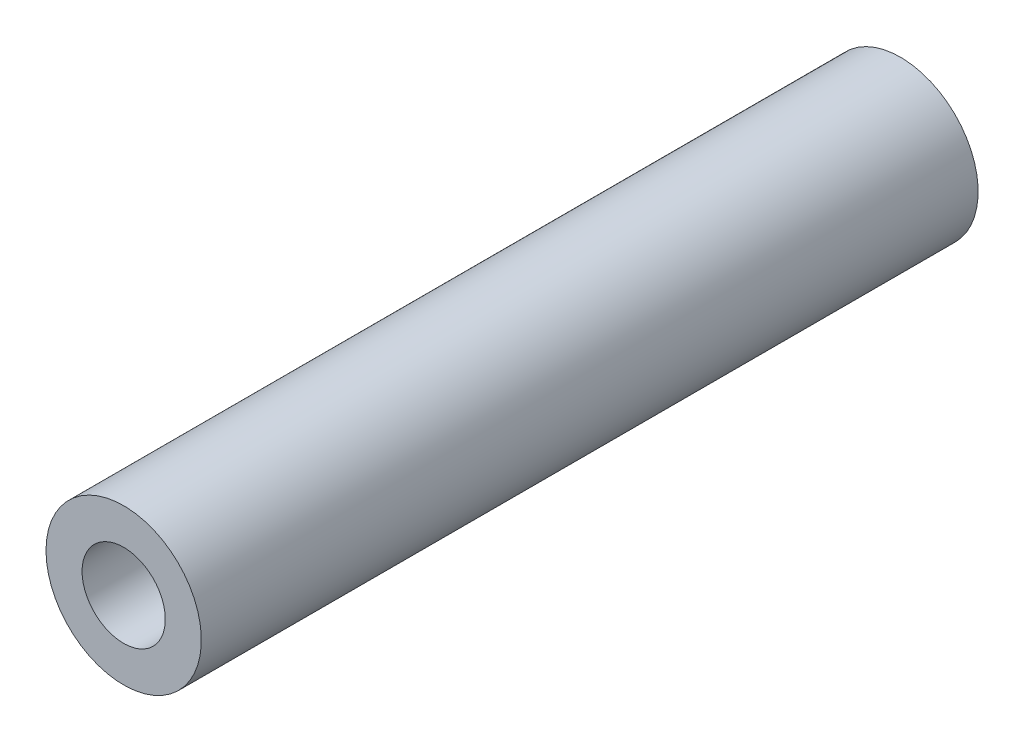
ISO-10303-21;
HEADER;
FILE_DESCRIPTION(('STEP AP214'),'2;1');
FILE_NAME('part.step','',(''),(''),'','','');
FILE_SCHEMA(('AUTOMOTIVE_DESIGN { 1 0 10303 214 1 1 1 1 }'));
ENDSEC;
DATA;
#1=APPLICATION_CONTEXT('core data for automotive mechanical design processes');
#2=APPLICATION_PROTOCOL_DEFINITION('international standard','automotive_design',2000,#1);
#3=PRODUCT_CONTEXT('',#1,'mechanical');
#4=PRODUCT('Part','Part','',(#3));
#5=PRODUCT_RELATED_PRODUCT_CATEGORY('part','',(#4));
#6=PRODUCT_DEFINITION_FORMATION('','',#4);
#7=PRODUCT_DEFINITION_CONTEXT('part definition',#1,'design');
#8=PRODUCT_DEFINITION('design','',#6,#7);
#9=PRODUCT_DEFINITION_SHAPE('','',#8);
#10=(LENGTH_UNIT() NAMED_UNIT(*) SI_UNIT(.MILLI.,.METRE.));
#11=(NAMED_UNIT(*) PLANE_ANGLE_UNIT() SI_UNIT($,.RADIAN.));
#12=(NAMED_UNIT(*) SI_UNIT($,.STERADIAN.) SOLID_ANGLE_UNIT());
#13=UNCERTAINTY_MEASURE_WITH_UNIT(LENGTH_MEASURE(1.E-05),#10,'distance_accuracy_value','');
#14=(GEOMETRIC_REPRESENTATION_CONTEXT(3) GLOBAL_UNCERTAINTY_ASSIGNED_CONTEXT((#13)) GLOBAL_UNIT_ASSIGNED_CONTEXT((#10,
#11,#12)) REPRESENTATION_CONTEXT('',''));
#15=CARTESIAN_POINT('',(0.,0.,0.));
#16=DIRECTION('',(0.,0.,1.));
#17=DIRECTION('',(1.,0.,0.));
#18=AXIS2_PLACEMENT_3D('',#15,#16,#17);
#19=CARTESIAN_POINT('',(0.,0.,23.8125));
#20=DIRECTION('',(0.,0.,-1.));
#21=DIRECTION('',(-1.,0.,0.));
#22=AXIS2_PLACEMENT_3D('',#19,#20,#21);
#23=CYLINDRICAL_SURFACE('',#22,2.5527);
#24=CARTESIAN_POINT('',(0.,0.,-23.8125));
#25=DIRECTION('',(0.,0.,-1.));
#26=DIRECTION('',(-1.,0.,0.));
#27=AXIS2_PLACEMENT_3D('',#24,#25,#26);
#28=CIRCLE('',#27,2.5527);
#29=CARTESIAN_POINT('',(-2.5527,0.,-23.8125));
#30=VERTEX_POINT('',#29);
#31=EDGE_CURVE('E27',#30,#30,#28,.T.);
#32=ORIENTED_EDGE('',*,*,#31,.T.);
#33=EDGE_LOOP('',(#32));
#34=FACE_BOUND('',#33,.T.);
#35=CARTESIAN_POINT('',(0.,0.,23.8125));
#36=DIRECTION('',(0.,0.,-1.));
#37=DIRECTION('',(-1.,0.,0.));
#38=AXIS2_PLACEMENT_3D('',#35,#36,#37);
#39=CIRCLE('',#38,2.5527);
#40=CARTESIAN_POINT('',(-2.5527,0.,23.8125));
#41=VERTEX_POINT('',#40);
#42=EDGE_CURVE('E18',#41,#41,#39,.T.);
#43=ORIENTED_EDGE('',*,*,#42,.F.);
#44=EDGE_LOOP('',(#43));
#45=FACE_BOUND('',#44,.T.);
#46=ADVANCED_FACE('F15',(#34,#45),#23,.F.);
#47=CARTESIAN_POINT('',(0.,0.,23.8125));
#48=DIRECTION('',(0.,0.,1.));
#49=DIRECTION('',(1.,0.,0.));
#50=AXIS2_PLACEMENT_3D('',#47,#48,#49);
#51=PLANE('',#50);
#52=ORIENTED_EDGE('',*,*,#42,.T.);
#53=EDGE_LOOP('',(#52));
#54=FACE_BOUND('',#53,.T.);
#55=CARTESIAN_POINT('',(0.,0.,23.8125));
#56=DIRECTION('',(0.,0.,-1.));
#57=DIRECTION('',(-1.,0.,0.));
#58=AXIS2_PLACEMENT_3D('',#55,#56,#57);
#59=CIRCLE('',#58,4.7625);
#60=CARTESIAN_POINT('',(-4.7625,0.,23.8125));
#61=VERTEX_POINT('',#60);
#62=EDGE_CURVE('E22',#61,#61,#59,.T.);
#63=ORIENTED_EDGE('',*,*,#62,.F.);
#64=EDGE_LOOP('',(#63));
#65=FACE_BOUND('',#64,.T.);
#66=ADVANCED_FACE('F35',(#54,#65),#51,.T.);
#67=CARTESIAN_POINT('',(0.,0.,-23.8125));
#68=DIRECTION('',(0.,0.,1.));
#69=DIRECTION('',(1.,0.,0.));
#70=AXIS2_PLACEMENT_3D('',#67,#68,#69);
#71=PLANE('',#70);
#72=ORIENTED_EDGE('',*,*,#31,.F.);
#73=EDGE_LOOP('',(#72));
#74=FACE_BOUND('',#73,.T.);
#75=CARTESIAN_POINT('',(0.,0.,-23.8125));
#76=DIRECTION('',(0.,0.,-1.));
#77=DIRECTION('',(-1.,0.,0.));
#78=AXIS2_PLACEMENT_3D('',#75,#76,#77);
#79=CIRCLE('',#78,4.7625);
#80=CARTESIAN_POINT('',(-4.7625,0.,-23.8125));
#81=VERTEX_POINT('',#80);
#82=EDGE_CURVE('E10',#81,#81,#79,.F.);
#83=ORIENTED_EDGE('',*,*,#82,.F.);
#84=EDGE_LOOP('',(#83));
#85=FACE_BOUND('',#84,.T.);
#86=ADVANCED_FACE('F43',(#74,#85),#71,.F.);
#87=CARTESIAN_POINT('',(0.,0.,23.8125));
#88=DIRECTION('',(0.,0.,-1.));
#89=DIRECTION('',(-1.,0.,0.));
#90=AXIS2_PLACEMENT_3D('',#87,#88,#89);
#91=CYLINDRICAL_SURFACE('',#90,4.7625);
#92=ORIENTED_EDGE('',*,*,#82,.T.);
#93=EDGE_LOOP('',(#92));
#94=FACE_BOUND('',#93,.T.);
#95=ORIENTED_EDGE('',*,*,#62,.T.);
#96=EDGE_LOOP('',(#95));
#97=FACE_BOUND('',#96,.T.);
#98=ADVANCED_FACE('F44',(#94,#97),#91,.T.);
#99=CLOSED_SHELL('',(#46,#66,#86,#98));
#100=MANIFOLD_SOLID_BREP('B1',#99);
#101=ADVANCED_BREP_SHAPE_REPRESENTATION('',(#18,#100),#14);
#102=SHAPE_DEFINITION_REPRESENTATION(#9,#101);
ENDSEC;
END-ISO-10303-21;
